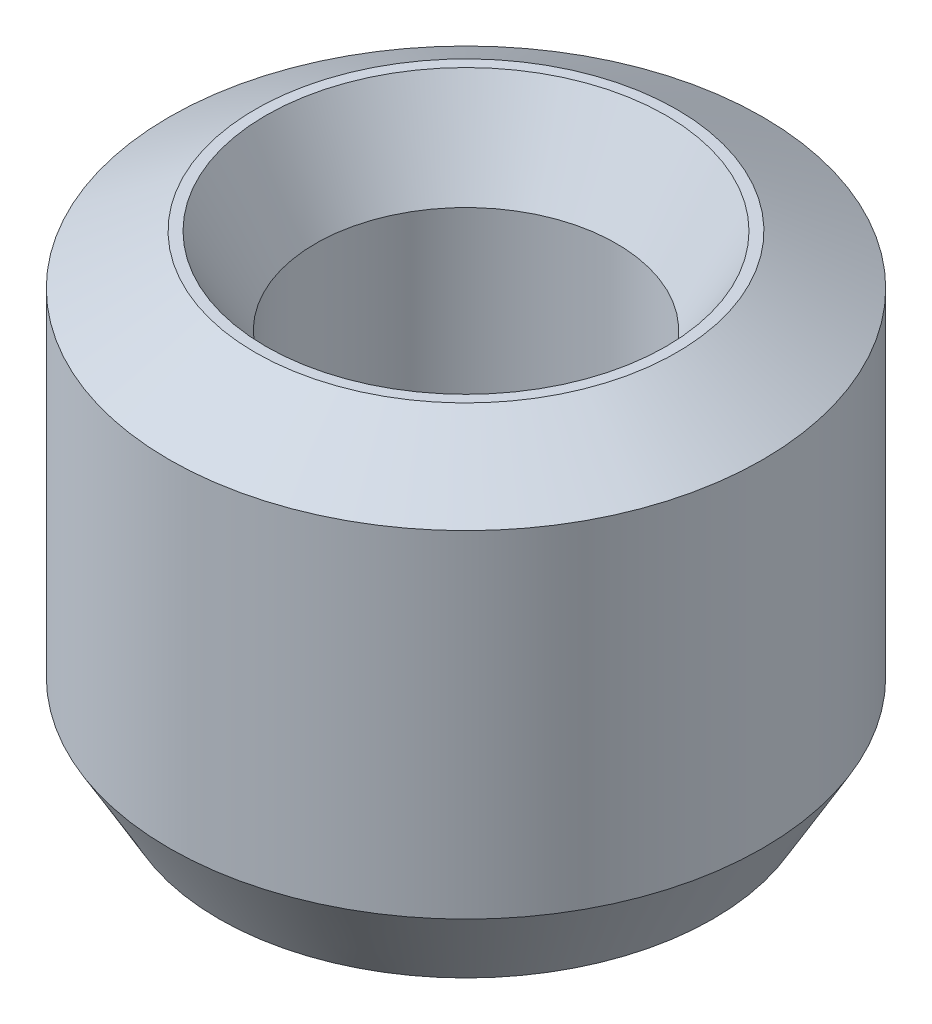
ISO-10303-21;
HEADER;
FILE_DESCRIPTION(('STEP AP214'),'2;1');
FILE_NAME('part.step','',(''),(''),'','','');
FILE_SCHEMA(('AUTOMOTIVE_DESIGN { 1 0 10303 214 1 1 1 1 }'));
ENDSEC;
DATA;
#1=APPLICATION_CONTEXT('core data for automotive mechanical design processes');
#2=APPLICATION_PROTOCOL_DEFINITION('international standard','automotive_design',2000,#1);
#3=PRODUCT_CONTEXT('',#1,'mechanical');
#4=PRODUCT('Part','Part','',(#3));
#5=PRODUCT_RELATED_PRODUCT_CATEGORY('part','',(#4));
#6=PRODUCT_DEFINITION_FORMATION('','',#4);
#7=PRODUCT_DEFINITION_CONTEXT('part definition',#1,'design');
#8=PRODUCT_DEFINITION('design','',#6,#7);
#9=PRODUCT_DEFINITION_SHAPE('','',#8);
#10=(LENGTH_UNIT() NAMED_UNIT(*) SI_UNIT(.MILLI.,.METRE.));
#11=(NAMED_UNIT(*) PLANE_ANGLE_UNIT() SI_UNIT($,.RADIAN.));
#12=(NAMED_UNIT(*) SI_UNIT($,.STERADIAN.) SOLID_ANGLE_UNIT());
#13=UNCERTAINTY_MEASURE_WITH_UNIT(LENGTH_MEASURE(1.E-05),#10,'distance_accuracy_value','');
#14=(GEOMETRIC_REPRESENTATION_CONTEXT(3) GLOBAL_UNCERTAINTY_ASSIGNED_CONTEXT((#13)) GLOBAL_UNIT_ASSIGNED_CONTEXT((#10,
#11,#12)) REPRESENTATION_CONTEXT('',''));
#15=CARTESIAN_POINT('',(0.,0.,0.));
#16=DIRECTION('',(0.,0.,1.));
#17=DIRECTION('',(1.,0.,0.));
#18=AXIS2_PLACEMENT_3D('',#15,#16,#17);
#19=CARTESIAN_POINT('',(0.,31.8252549214163,0.));
#20=DIRECTION('',(0.,-1.,0.));
#21=DIRECTION('',(0.,0.,-1.));
#22=AXIS2_PLACEMENT_3D('',#19,#20,#21);
#23=CYLINDRICAL_SURFACE('',#22,20.);
#24=CARTESIAN_POINT('',(0.,5.8014895770544,0.));
#25=DIRECTION('',(0.,1.,0.));
#26=DIRECTION('',(0.,0.,1.));
#27=AXIS2_PLACEMENT_3D('',#24,#25,#26);
#28=CIRCLE('',#27,20.);
#29=CARTESIAN_POINT('',(0.,5.8014895770544,20.));
#30=VERTEX_POINT('',#29);
#31=EDGE_CURVE('E10',#30,#30,#28,.T.);
#32=ORIENTED_EDGE('',*,*,#31,.T.);
#33=EDGE_LOOP('',(#32));
#34=FACE_BOUND('',#33,.T.);
#35=CARTESIAN_POINT('',(0.,28.4757633524031,0.));
#36=DIRECTION('',(0.,1.,0.));
#37=DIRECTION('',(0.,0.,1.));
#38=AXIS2_PLACEMENT_3D('',#35,#36,#37);
#39=CIRCLE('',#38,20.);
#40=CARTESIAN_POINT('',(0.,28.4757633524031,20.));
#41=VERTEX_POINT('',#40);
#42=EDGE_CURVE('E50',#41,#41,#39,.F.);
#43=ORIENTED_EDGE('',*,*,#42,.T.);
#44=EDGE_LOOP('',(#43));
#45=FACE_BOUND('',#44,.T.);
#46=ADVANCED_FACE('F39',(#34,#45),#23,.T.);
#47=CARTESIAN_POINT('',(0.,31.8252549214163,0.));
#48=DIRECTION('',(0.,1.,0.));
#49=DIRECTION('',(0.,0.,1.));
#50=AXIS2_PLACEMENT_3D('',#47,#48,#49);
#51=PLANE('',#50);
#52=CARTESIAN_POINT('',(0.,31.8252549214163,0.));
#53=DIRECTION('',(0.,1.,0.));
#54=DIRECTION('',(0.,0.,1.));
#55=AXIS2_PLACEMENT_3D('',#52,#53,#54);
#56=CIRCLE('',#55,13.4860633079824);
#57=CARTESIAN_POINT('',(0.,31.8252549214163,13.4860633079824));
#58=VERTEX_POINT('',#57);
#59=EDGE_CURVE('E58',#58,#58,#56,.F.);
#60=ORIENTED_EDGE('',*,*,#59,.T.);
#61=EDGE_LOOP('',(#60));
#62=FACE_BOUND('',#61,.T.);
#63=CARTESIAN_POINT('',(0.,31.8252549214163,0.));
#64=DIRECTION('',(0.,1.,0.));
#65=DIRECTION('',(0.,0.,1.));
#66=AXIS2_PLACEMENT_3D('',#63,#64,#65);
#67=CIRCLE('',#66,14.1985104229456);
#68=CARTESIAN_POINT('',(0.,31.8252549214163,14.1985104229456));
#69=VERTEX_POINT('',#68);
#70=EDGE_CURVE('E61',#69,#69,#67,.T.);
#71=ORIENTED_EDGE('',*,*,#70,.T.);
#72=EDGE_LOOP('',(#71));
#73=FACE_BOUND('',#72,.T.);
#74=ADVANCED_FACE('F88',(#62,#73),#51,.T.);
#75=CARTESIAN_POINT('',(0.,0.,0.));
#76=DIRECTION('',(0.,1.,0.));
#77=DIRECTION('',(0.,0.,1.));
#78=AXIS2_PLACEMENT_3D('',#75,#76,#77);
#79=PLANE('',#78);
#80=CARTESIAN_POINT('',(0.,0.,0.));
#81=DIRECTION('',(0.,1.,0.));
#82=DIRECTION('',(0.,0.,1.));
#83=AXIS2_PLACEMENT_3D('',#80,#81,#82);
#84=CIRCLE('',#83,15.9380613160236);
#85=CARTESIAN_POINT('',(0.,0.,15.9380613160236));
#86=VERTEX_POINT('',#85);
#87=EDGE_CURVE('E51',#86,#86,#84,.T.);
#88=ORIENTED_EDGE('',*,*,#87,.T.);
#89=EDGE_LOOP('',(#88));
#90=FACE_BOUND('',#89,.T.);
#91=CARTESIAN_POINT('',(0.,0.,0.));
#92=DIRECTION('',(0.,1.,0.));
#93=DIRECTION('',(0.,0.,1.));
#94=AXIS2_PLACEMENT_3D('',#91,#92,#93);
#95=CIRCLE('',#94,16.6505084309868);
#96=CARTESIAN_POINT('',(0.,0.,16.6505084309868));
#97=VERTEX_POINT('',#96);
#98=EDGE_CURVE('E54',#97,#97,#95,.F.);
#99=ORIENTED_EDGE('',*,*,#98,.T.);
#100=EDGE_LOOP('',(#99));
#101=FACE_BOUND('',#100,.T.);
#102=ADVANCED_FACE('F83',(#90,#101),#79,.F.);
#103=CARTESIAN_POINT('',(0.,31.8252549214163,0.));
#104=DIRECTION('',(0.,-1.,0.));
#105=DIRECTION('',(0.,0.,-1.));
#106=AXIS2_PLACEMENT_3D('',#103,#104,#105);
#107=CYLINDRICAL_SURFACE('',#106,10.1365717389693);
#108=CARTESIAN_POINT('',(0.,26.0237653443619,0.));
#109=DIRECTION('',(0.,1.,0.));
#110=DIRECTION('',(0.,0.,1.));
#111=AXIS2_PLACEMENT_3D('',#108,#109,#110);
#112=CIRCLE('',#111,10.1365717389693);
#113=CARTESIAN_POINT('',(0.,26.0237653443619,10.1365717389693));
#114=VERTEX_POINT('',#113);
#115=EDGE_CURVE('E67',#114,#114,#112,.T.);
#116=ORIENTED_EDGE('',*,*,#115,.T.);
#117=EDGE_LOOP('',(#116));
#118=FACE_BOUND('',#117,.T.);
#119=CARTESIAN_POINT('',(0.,3.34949156901318,0.));
#120=DIRECTION('',(0.,1.,0.));
#121=DIRECTION('',(0.,0.,1.));
#122=AXIS2_PLACEMENT_3D('',#119,#120,#121);
#123=CIRCLE('',#122,10.1365717389693);
#124=CARTESIAN_POINT('',(0.,3.34949156901318,10.1365717389693));
#125=VERTEX_POINT('',#124);
#126=EDGE_CURVE('E69',#125,#125,#123,.F.);
#127=ORIENTED_EDGE('',*,*,#126,.T.);
#128=EDGE_LOOP('',(#127));
#129=FACE_BOUND('',#128,.T.);
#130=ADVANCED_FACE('F71',(#118,#129),#107,.F.);
#131=CARTESIAN_POINT('',(0.,26.0237653443619,0.));
#132=DIRECTION('',(0.,1.,0.));
#133=DIRECTION('',(0.,0.,1.));
#134=AXIS2_PLACEMENT_3D('',#131,#132,#133);
#135=CONICAL_SURFACE('',#134,10.1365717389693,0.523598775598303);
#136=ORIENTED_EDGE('',*,*,#59,.F.);
#137=EDGE_LOOP('',(#136));
#138=FACE_BOUND('',#137,.T.);
#139=ORIENTED_EDGE('',*,*,#115,.F.);
#140=EDGE_LOOP('',(#139));
#141=FACE_BOUND('',#140,.T.);
#142=ADVANCED_FACE('F77',(#138,#141),#135,.F.);
#143=CARTESIAN_POINT('',(0.,0.,0.));
#144=DIRECTION('',(0.,-1.,0.));
#145=DIRECTION('',(0.,0.,-1.));
#146=AXIS2_PLACEMENT_3D('',#143,#144,#145);
#147=CONICAL_SURFACE('',#146,15.9380613160236,1.04719755119659);
#148=ORIENTED_EDGE('',*,*,#126,.F.);
#149=EDGE_LOOP('',(#148));
#150=FACE_BOUND('',#149,.T.);
#151=ORIENTED_EDGE('',*,*,#87,.F.);
#152=EDGE_LOOP('',(#151));
#153=FACE_BOUND('',#152,.T.);
#154=ADVANCED_FACE('F73',(#150,#153),#147,.F.);
#155=CARTESIAN_POINT('',(0.,5.8014895770544,0.));
#156=DIRECTION('',(0.,1.,0.));
#157=DIRECTION('',(0.,0.,1.));
#158=AXIS2_PLACEMENT_3D('',#155,#156,#157);
#159=CONICAL_SURFACE('',#158,20.,0.523598775598302);
#160=ORIENTED_EDGE('',*,*,#98,.F.);
#161=EDGE_LOOP('',(#160));
#162=FACE_BOUND('',#161,.T.);
#163=ORIENTED_EDGE('',*,*,#31,.F.);
#164=EDGE_LOOP('',(#163));
#165=FACE_BOUND('',#164,.T.);
#166=ADVANCED_FACE('F76',(#162,#165),#159,.T.);
#167=CARTESIAN_POINT('',(0.,31.8252549214163,0.));
#168=DIRECTION('',(0.,-1.,0.));
#169=DIRECTION('',(0.,0.,-1.));
#170=AXIS2_PLACEMENT_3D('',#167,#168,#169);
#171=CONICAL_SURFACE('',#170,14.1985104229456,1.04719755119659);
#172=ORIENTED_EDGE('',*,*,#42,.F.);
#173=EDGE_LOOP('',(#172));
#174=FACE_BOUND('',#173,.T.);
#175=ORIENTED_EDGE('',*,*,#70,.F.);
#176=EDGE_LOOP('',(#175));
#177=FACE_BOUND('',#176,.T.);
#178=ADVANCED_FACE('F45',(#174,#177),#171,.T.);
#179=CLOSED_SHELL('',(#46,#74,#102,#130,#142,#154,#166,#178));
#180=MANIFOLD_SOLID_BREP('B2',#179);
#181=ADVANCED_BREP_SHAPE_REPRESENTATION('',(#18,#180),#14);
#182=SHAPE_DEFINITION_REPRESENTATION(#9,#181);
ENDSEC;
END-ISO-10303-21;
